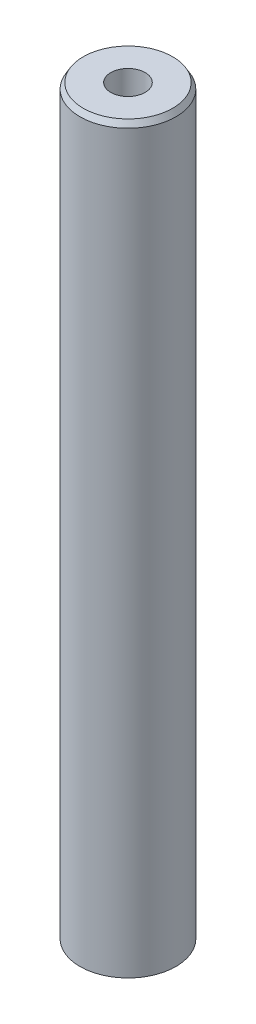
ISO-10303-21;
HEADER;
FILE_DESCRIPTION(('STEP AP214'),'2;1');
FILE_NAME('part.step','',(''),(''),'','','');
FILE_SCHEMA(('AUTOMOTIVE_DESIGN { 1 0 10303 214 1 1 1 1 }'));
ENDSEC;
DATA;
#1=APPLICATION_CONTEXT('core data for automotive mechanical design processes');
#2=APPLICATION_PROTOCOL_DEFINITION('international standard','automotive_design',2000,#1);
#3=PRODUCT_CONTEXT('',#1,'mechanical');
#4=PRODUCT('Part','Part','',(#3));
#5=PRODUCT_RELATED_PRODUCT_CATEGORY('part','',(#4));
#6=PRODUCT_DEFINITION_FORMATION('','',#4);
#7=PRODUCT_DEFINITION_CONTEXT('part definition',#1,'design');
#8=PRODUCT_DEFINITION('design','',#6,#7);
#9=PRODUCT_DEFINITION_SHAPE('','',#8);
#10=(LENGTH_UNIT() NAMED_UNIT(*) SI_UNIT(.MILLI.,.METRE.));
#11=(NAMED_UNIT(*) PLANE_ANGLE_UNIT() SI_UNIT($,.RADIAN.));
#12=(NAMED_UNIT(*) SI_UNIT($,.STERADIAN.) SOLID_ANGLE_UNIT());
#13=UNCERTAINTY_MEASURE_WITH_UNIT(LENGTH_MEASURE(1.E-05),#10,'distance_accuracy_value','');
#14=(GEOMETRIC_REPRESENTATION_CONTEXT(3) GLOBAL_UNCERTAINTY_ASSIGNED_CONTEXT((#13)) GLOBAL_UNIT_ASSIGNED_CONTEXT((#10,
#11,#12)) REPRESENTATION_CONTEXT('',''));
#15=CARTESIAN_POINT('',(0.,0.,0.));
#16=DIRECTION('',(0.,0.,1.));
#17=DIRECTION('',(1.,0.,0.));
#18=AXIS2_PLACEMENT_3D('',#15,#16,#17);
#19=CARTESIAN_POINT('',(0.,504.307032383684,0.));
#20=DIRECTION('',(0.,-1.,0.));
#21=DIRECTION('',(0.,0.,-1.));
#22=AXIS2_PLACEMENT_3D('',#19,#20,#21);
#23=CYLINDRICAL_SURFACE('',#22,32.5);
#24=CARTESIAN_POINT('',(0.,500.441309905654,0.));
#25=DIRECTION('',(0.,1.,0.));
#26=DIRECTION('',(0.,0.,1.));
#27=AXIS2_PLACEMENT_3D('',#24,#25,#26);
#28=CIRCLE('',#27,32.5);
#29=CARTESIAN_POINT('',(0.,500.441309905654,32.5));
#30=VERTEX_POINT('',#29);
#31=EDGE_CURVE('E50',#30,#30,#28,.F.);
#32=ORIENTED_EDGE('',*,*,#31,.T.);
#33=EDGE_LOOP('',(#32));
#34=FACE_BOUND('',#33,.T.);
#35=CARTESIAN_POINT('',(0.,2.24183154097268,0.));
#36=DIRECTION('',(0.,1.,0.));
#37=DIRECTION('',(0.,0.,1.));
#38=AXIS2_PLACEMENT_3D('',#35,#36,#37);
#39=CIRCLE('',#38,32.5);
#40=CARTESIAN_POINT('',(0.,2.24183154097268,32.5));
#41=VERTEX_POINT('',#40);
#42=EDGE_CURVE('E51',#41,#41,#39,.T.);
#43=ORIENTED_EDGE('',*,*,#42,.T.);
#44=EDGE_LOOP('',(#43));
#45=FACE_BOUND('',#44,.T.);
#46=ADVANCED_FACE('F39',(#34,#45),#23,.T.);
#47=CARTESIAN_POINT('',(0.,504.307032383684,0.));
#48=DIRECTION('',(0.,1.,0.));
#49=DIRECTION('',(0.,0.,1.));
#50=AXIS2_PLACEMENT_3D('',#47,#48,#49);
#51=PLANE('',#50);
#52=CARTESIAN_POINT('',(0.,504.307032383684,0.));
#53=DIRECTION('',(0.,1.,0.));
#54=DIRECTION('',(0.,0.,1.));
#55=AXIS2_PLACEMENT_3D('',#52,#53,#54);
#56=CIRCLE('',#55,30.2581684590272);
#57=CARTESIAN_POINT('',(0.,504.307032383684,30.2581684590272));
#58=VERTEX_POINT('',#57);
#59=EDGE_CURVE('E54',#58,#58,#56,.T.);
#60=ORIENTED_EDGE('',*,*,#59,.T.);
#61=EDGE_LOOP('',(#60));
#62=FACE_BOUND('',#61,.T.);
#63=CARTESIAN_POINT('',(0.,504.307032383684,0.));
#64=DIRECTION('',(0.,1.,0.));
#65=DIRECTION('',(0.,0.,1.));
#66=AXIS2_PLACEMENT_3D('',#63,#64,#65);
#67=CIRCLE('',#66,11.6462044468272);
#68=CARTESIAN_POINT('',(0.,504.307032383684,11.6462044468272));
#69=VERTEX_POINT('',#68);
#70=EDGE_CURVE('E58',#69,#69,#67,.T.);
#71=ORIENTED_EDGE('',*,*,#70,.F.);
#72=EDGE_LOOP('',(#71));
#73=FACE_BOUND('',#72,.T.);
#74=ADVANCED_FACE('F69',(#62,#73),#51,.T.);
#75=CARTESIAN_POINT('',(0.,0.,0.));
#76=DIRECTION('',(0.,1.,0.));
#77=DIRECTION('',(0.,0.,1.));
#78=AXIS2_PLACEMENT_3D('',#75,#76,#77);
#79=PLANE('',#78);
#80=CARTESIAN_POINT('',(0.,0.,0.));
#81=DIRECTION('',(0.,1.,0.));
#82=DIRECTION('',(0.,0.,1.));
#83=AXIS2_PLACEMENT_3D('',#80,#81,#82);
#84=CIRCLE('',#83,28.6342775219692);
#85=CARTESIAN_POINT('',(0.,0.,28.6342775219692));
#86=VERTEX_POINT('',#85);
#87=EDGE_CURVE('E10',#86,#86,#84,.F.);
#88=ORIENTED_EDGE('',*,*,#87,.T.);
#89=EDGE_LOOP('',(#88));
#90=FACE_BOUND('',#89,.T.);
#91=CARTESIAN_POINT('',(0.,0.,0.));
#92=DIRECTION('',(0.,1.,0.));
#93=DIRECTION('',(0.,0.,1.));
#94=AXIS2_PLACEMENT_3D('',#91,#92,#93);
#95=CIRCLE('',#94,11.6462044468272);
#96=CARTESIAN_POINT('',(0.,0.,11.6462044468272));
#97=VERTEX_POINT('',#96);
#98=EDGE_CURVE('E63',#97,#97,#95,.T.);
#99=ORIENTED_EDGE('',*,*,#98,.T.);
#100=EDGE_LOOP('',(#99));
#101=FACE_BOUND('',#100,.T.);
#102=ADVANCED_FACE('F75',(#90,#101),#79,.F.);
#103=CARTESIAN_POINT('',(0.,504.307032383684,0.));
#104=DIRECTION('',(0.,-1.,0.));
#105=DIRECTION('',(0.,0.,-1.));
#106=AXIS2_PLACEMENT_3D('',#103,#104,#105);
#107=CYLINDRICAL_SURFACE('',#106,11.6462044468272);
#108=ORIENTED_EDGE('',*,*,#70,.T.);
#109=EDGE_LOOP('',(#108));
#110=FACE_BOUND('',#109,.T.);
#111=ORIENTED_EDGE('',*,*,#98,.F.);
#112=EDGE_LOOP('',(#111));
#113=FACE_BOUND('',#112,.T.);
#114=ADVANCED_FACE('F70',(#110,#113),#107,.F.);
#115=CARTESIAN_POINT('',(0.,504.307032383684,0.));
#116=DIRECTION('',(0.,-1.,0.));
#117=DIRECTION('',(0.,0.,-1.));
#118=AXIS2_PLACEMENT_3D('',#115,#116,#117);
#119=CONICAL_SURFACE('',#118,30.2581684590272,0.525528141764494);
#120=ORIENTED_EDGE('',*,*,#31,.F.);
#121=EDGE_LOOP('',(#120));
#122=FACE_BOUND('',#121,.T.);
#123=ORIENTED_EDGE('',*,*,#59,.F.);
#124=EDGE_LOOP('',(#123));
#125=FACE_BOUND('',#124,.T.);
#126=ADVANCED_FACE('F81',(#122,#125),#119,.T.);
#127=CARTESIAN_POINT('',(0.,2.24183154097268,0.));
#128=DIRECTION('',(0.,1.,0.));
#129=DIRECTION('',(0.,0.,1.));
#130=AXIS2_PLACEMENT_3D('',#127,#128,#129);
#131=CONICAL_SURFACE('',#130,32.5,1.04526818503042);
#132=ORIENTED_EDGE('',*,*,#87,.F.);
#133=EDGE_LOOP('',(#132));
#134=FACE_BOUND('',#133,.T.);
#135=ORIENTED_EDGE('',*,*,#42,.F.);
#136=EDGE_LOOP('',(#135));
#137=FACE_BOUND('',#136,.T.);
#138=ADVANCED_FACE('F45',(#134,#137),#131,.T.);
#139=CLOSED_SHELL('',(#46,#74,#102,#114,#126,#138));
#140=MANIFOLD_SOLID_BREP('B2',#139);
#141=ADVANCED_BREP_SHAPE_REPRESENTATION('',(#18,#140),#14);
#142=SHAPE_DEFINITION_REPRESENTATION(#9,#141);
ENDSEC;
END-ISO-10303-21;
